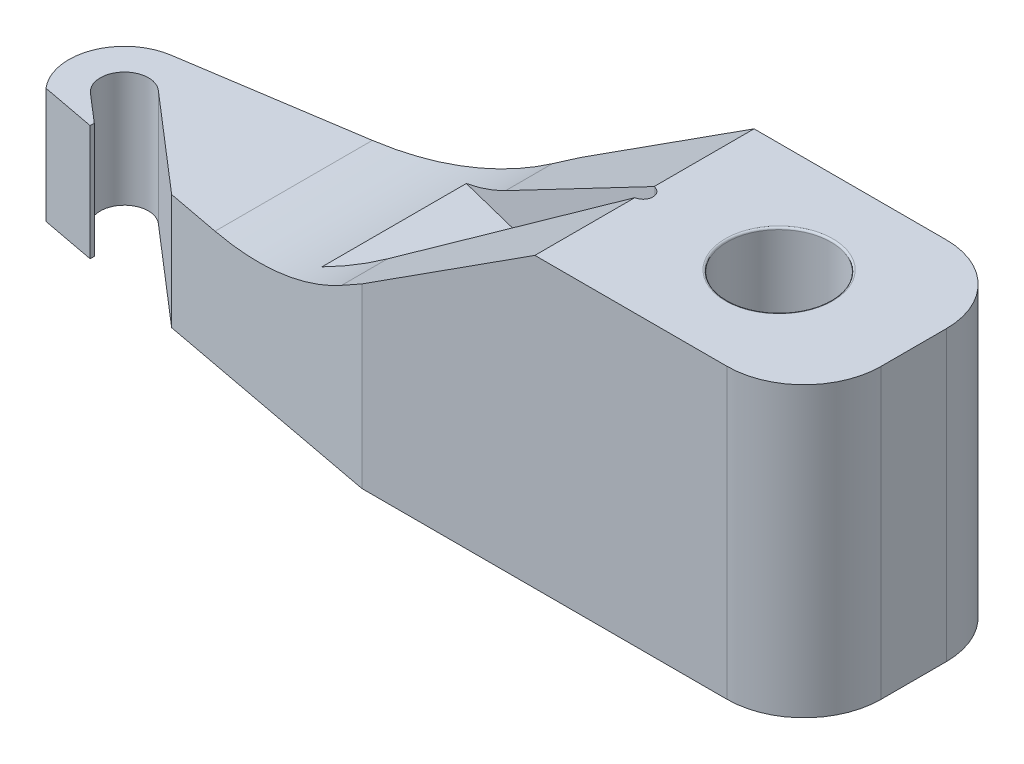
ISO-10303-21;
HEADER;
FILE_DESCRIPTION(('STEP AP214'),'2;1');
FILE_NAME('part.step','',(''),(''),'','','');
FILE_SCHEMA(('AUTOMOTIVE_DESIGN { 1 0 10303 214 1 1 1 1 }'));
ENDSEC;
DATA;
#1=APPLICATION_CONTEXT('core data for automotive mechanical design processes');
#2=APPLICATION_PROTOCOL_DEFINITION('international standard','automotive_design',2000,#1);
#3=PRODUCT_CONTEXT('',#1,'mechanical');
#4=PRODUCT('Part','Part','',(#3));
#5=PRODUCT_RELATED_PRODUCT_CATEGORY('part','',(#4));
#6=PRODUCT_DEFINITION_FORMATION('','',#4);
#7=PRODUCT_DEFINITION_CONTEXT('part definition',#1,'design');
#8=PRODUCT_DEFINITION('design','',#6,#7);
#9=PRODUCT_DEFINITION_SHAPE('','',#8);
#10=(LENGTH_UNIT() NAMED_UNIT(*) SI_UNIT(.MILLI.,.METRE.));
#11=(NAMED_UNIT(*) PLANE_ANGLE_UNIT() SI_UNIT($,.RADIAN.));
#12=(NAMED_UNIT(*) SI_UNIT($,.STERADIAN.) SOLID_ANGLE_UNIT());
#13=UNCERTAINTY_MEASURE_WITH_UNIT(LENGTH_MEASURE(1.E-05),#10,'distance_accuracy_value','');
#14=(GEOMETRIC_REPRESENTATION_CONTEXT(3) GLOBAL_UNCERTAINTY_ASSIGNED_CONTEXT((#13)) GLOBAL_UNIT_ASSIGNED_CONTEXT((#10,
#11,#12)) REPRESENTATION_CONTEXT('',''));
#15=CARTESIAN_POINT('',(0.,0.,0.));
#16=DIRECTION('',(0.,0.,1.));
#17=DIRECTION('',(1.,0.,0.));
#18=AXIS2_PLACEMENT_3D('',#15,#16,#17);
#19=CARTESIAN_POINT('',(-2.1,0.6,-0.57));
#20=DIRECTION('',(0.540757591313499,-0.841178475376553,0.));
#21=DIRECTION('',(0.841178475376554,0.540757591313499,0.));
#22=AXIS2_PLACEMENT_3D('',#19,#20,#21);
#23=PLANE('',#22);
#24=DIRECTION('',(0.,0.,1.));
#25=VECTOR('',#24,1.);
#26=CARTESIAN_POINT('',(-0.7,1.5,-0.57));
#27=LINE('',#26,#25);
#28=CARTESIAN_POINT('',(-0.7,1.5,0.05));
#29=VERTEX_POINT('',#28);
#30=CARTESIAN_POINT('',(-0.7,1.5,0.57));
#31=VERTEX_POINT('',#30);
#32=EDGE_CURVE('E325',#29,#31,#27,.T.);
#33=ORIENTED_EDGE('',*,*,#32,.F.);
#34=DIRECTION('',(-0.823173444852997,-0.529182928834069,0.205793361213249));
#35=VECTOR('',#34,1.);
#36=CARTESIAN_POINT('',(-1.93567847882455,0.705635263612792,0.358919619706137));
#37=LINE('',#36,#35);
#38=CARTESIAN_POINT('',(-1.72941644254529,0.83823228693517,0.307354110636323));
#39=VERTEX_POINT('',#38);
#40=EDGE_CURVE('E711',#29,#39,#37,.T.);
#41=ORIENTED_EDGE('',*,*,#40,.T.);
#42=DIRECTION('',(0.,0.,1.));
#43=VECTOR('',#42,1.);
#44=CARTESIAN_POINT('',(-1.72941644254529,0.83823228693517,0.475788473531962));
#45=LINE('',#44,#43);
#46=CARTESIAN_POINT('',(-1.72941644254529,0.838232286935169,0.54561495879549));
#47=VERTEX_POINT('',#46);
#48=EDGE_CURVE('E207',#39,#47,#45,.T.);
#49=ORIENTED_EDGE('',*,*,#48,.T.);
#50=DIRECTION('',(0.830807665061852,0.534090641825476,0.156543316653647));
#51=VECTOR('',#50,1.);
#52=CARTESIAN_POINT('',(-0.313018976374494,1.74877351518783,0.812496893542314));
#53=LINE('',#52,#51);
#54=CARTESIAN_POINT('',(-1.6,0.921428571428571,0.57));
#55=VERTEX_POINT('',#54);
#56=EDGE_CURVE('E702',#47,#55,#53,.T.);
#57=ORIENTED_EDGE('',*,*,#56,.T.);
#58=DIRECTION('',(0.841178475376553,0.540757591313499,0.));
#59=VECTOR('',#58,1.);
#60=CARTESIAN_POINT('',(-2.1,0.6,0.57));
#61=LINE('',#60,#59);
#62=EDGE_CURVE('E706',#55,#31,#61,.T.);
#63=ORIENTED_EDGE('',*,*,#62,.T.);
#64=EDGE_LOOP('',(#33,#41,#49,#57,#63));
#65=FACE_BOUND('',#64,.T.);
#66=ADVANCED_FACE('F41',(#65),#23,.F.);
#67=CARTESIAN_POINT('',(-0.122581688768,1.5,-0.797181053542187));
#68=DIRECTION('',(0.151982635355264,0.,0.98838316383398));
#69=DIRECTION('',(0.98838316383398,0.,-0.151982635355264));
#70=AXIS2_PLACEMENT_3D('',#67,#68,#69);
#71=PLANE('',#70);
#72=DIRECTION('',(0.98838316383398,0.,-0.151982635355264));
#73=VECTOR('',#72,1.);
#74=CARTESIAN_POINT('',(-0.122581688768,0.6,-0.797181053542187));
#75=LINE('',#74,#73);
#76=CARTESIAN_POINT('',(-3.44884977111822,0.6,-0.285704323108317));
#77=VERTEX_POINT('',#76);
#78=CARTESIAN_POINT('',(-2.54055282951554,0.6,-0.42537218464333));
#79=VERTEX_POINT('',#78);
#80=EDGE_CURVE('E648',#77,#79,#75,.T.);
#81=ORIENTED_EDGE('',*,*,#80,.T.);
#82=CARTESIAN_POINT('',(-2.54055282951554,2.1,-0.42537218464333));
#83=DIRECTION('',(0.151982635355264,0.,0.98838316383398));
#84=DIRECTION('',(0.98838316383398,0.,-0.151982635355264));
#85=AXIS2_PLACEMENT_3D('',#82,#83,#84);
#86=ELLIPSE('',#85,1.51763005976492,1.5);
#87=CARTESIAN_POINT('',(-1.72941644254529,0.83823228693517,-0.55009977029552));
#88=VERTEX_POINT('',#87);
#89=EDGE_CURVE('E281',#79,#88,#86,.T.);
#90=ORIENTED_EDGE('',*,*,#89,.T.);
#91=DIRECTION('',(0.834228815681276,0.536289952937963,-0.128278484029133));
#92=VECTOR('',#91,1.);
#93=CARTESIAN_POINT('',(-0.28865118713038,1.76443852255904,-0.771644722150891));
#94=LINE('',#93,#92);
#95=CARTESIAN_POINT('',(-1.6,0.921428571428571,-0.57));
#96=VERTEX_POINT('',#95);
#97=EDGE_CURVE('E266',#88,#96,#94,.T.);
#98=ORIENTED_EDGE('',*,*,#97,.T.);
#99=DIRECTION('',(0.,-1.,0.));
#100=VECTOR('',#99,1.);
#101=CARTESIAN_POINT('',(-1.6,1.5,-0.57));
#102=LINE('',#101,#100);
#103=CARTESIAN_POINT('',(-1.6,0.,-0.57));
#104=VERTEX_POINT('',#103);
#105=EDGE_CURVE('E349',#96,#104,#102,.T.);
#106=ORIENTED_EDGE('',*,*,#105,.T.);
#107=DIRECTION('',(-0.98838316383398,0.,0.151982635355264));
#108=VECTOR('',#107,1.);
#109=CARTESIAN_POINT('',(-0.122581688768,0.,-0.797181053542187));
#110=LINE('',#109,#108);
#111=CARTESIAN_POINT('',(-3.44884977111822,0.,-0.285704323108316));
#112=VERTEX_POINT('',#111);
#113=EDGE_CURVE('E643',#104,#112,#110,.T.);
#114=ORIENTED_EDGE('',*,*,#113,.T.);
#115=DIRECTION('',(0.,-1.,0.));
#116=VECTOR('',#115,1.);
#117=CARTESIAN_POINT('',(-3.44884977111822,1.5,-0.285704323108316));
#118=LINE('',#117,#116);
#119=EDGE_CURVE('E375',#77,#112,#118,.T.);
#120=ORIENTED_EDGE('',*,*,#119,.F.);
#121=EDGE_LOOP('',(#81,#90,#98,#106,#114,#120));
#122=FACE_BOUND('',#121,.T.);
#123=ADVANCED_FACE('F232',(#122),#71,.F.);
#124=CARTESIAN_POINT('',(-3.40491731906192,1.5,0.));
#125=DIRECTION('',(0.,-1.,0.));
#126=DIRECTION('',(0.,0.,-1.));
#127=AXIS2_PLACEMENT_3D('',#124,#125,#126);
#128=CYLINDRICAL_SURFACE('',#127,0.28906231263598);
#129=DIRECTION('',(0.,-1.,0.));
#130=VECTOR('',#129,1.);
#131=CARTESIAN_POINT('',(-3.62393969185987,1.5,0.188643104301263));
#132=LINE('',#131,#130);
#133=CARTESIAN_POINT('',(-3.62393969185987,0.6,0.188643104301263));
#134=VERTEX_POINT('',#133);
#135=CARTESIAN_POINT('',(-3.62393969185987,0.,0.188643104301263));
#136=VERTEX_POINT('',#135);
#137=EDGE_CURVE('E372',#134,#136,#132,.T.);
#138=ORIENTED_EDGE('',*,*,#137,.F.);
#139=CARTESIAN_POINT('',(-3.40491731906192,0.6,0.));
#140=DIRECTION('',(0.,-1.,0.));
#141=DIRECTION('',(0.,0.,-1.));
#142=AXIS2_PLACEMENT_3D('',#139,#140,#141);
#143=CIRCLE('',#142,0.28906231263598);
#144=EDGE_CURVE('E729',#134,#77,#143,.T.);
#145=ORIENTED_EDGE('',*,*,#144,.T.);
#146=ORIENTED_EDGE('',*,*,#119,.T.);
#147=CARTESIAN_POINT('',(-3.40491731906192,0.,0.));
#148=DIRECTION('',(0.,1.,0.));
#149=DIRECTION('',(0.,0.,1.));
#150=AXIS2_PLACEMENT_3D('',#147,#148,#149);
#151=CIRCLE('',#150,0.28906231263598);
#152=EDGE_CURVE('E647',#112,#136,#151,.T.);
#153=ORIENTED_EDGE('',*,*,#152,.T.);
#154=EDGE_LOOP('',(#138,#145,#146,#153));
#155=FACE_BOUND('',#154,.T.);
#156=ADVANCED_FACE('F239',(#155),#128,.T.);
#157=CARTESIAN_POINT('',(-0.158576359536371,1.5,0.84159744291039));
#158=DIRECTION('',(-0.185164745978843,0.,0.982707493024547));
#159=DIRECTION('',(0.982707493024547,0.,0.185164745978843));
#160=AXIS2_PLACEMENT_3D('',#157,#158,#159);
#161=PLANE('',#160);
#162=DIRECTION('',(0.982707493024547,0.,0.185164745978843));
#163=VECTOR('',#162,1.);
#164=CARTESIAN_POINT('',(-0.158576359536371,0.6,0.84159744291039));
#165=LINE('',#164,#163);
#166=CARTESIAN_POINT('',(-3.34104041971964,0.6,0.241947848831319));
#167=VERTEX_POINT('',#166);
#168=EDGE_CURVE('E726',#134,#167,#165,.T.);
#169=ORIENTED_EDGE('',*,*,#168,.F.);
#170=ORIENTED_EDGE('',*,*,#137,.T.);
#171=DIRECTION('',(-0.982707493024547,0.,-0.185164745978843));
#172=VECTOR('',#171,1.);
#173=CARTESIAN_POINT('',(-0.158576359536371,0.,0.84159744291039));
#174=LINE('',#173,#172);
#175=CARTESIAN_POINT('',(-3.34104041971964,0.,0.241947848831319));
#176=VERTEX_POINT('',#175);
#177=EDGE_CURVE('E652',#176,#136,#174,.T.);
#178=ORIENTED_EDGE('',*,*,#177,.F.);
#179=DIRECTION('',(0.,-1.,0.));
#180=VECTOR('',#179,1.);
#181=CARTESIAN_POINT('',(-3.34104041971964,1.5,0.241947848831319));
#182=LINE('',#181,#180);
#183=EDGE_CURVE('E369',#167,#176,#182,.T.);
#184=ORIENTED_EDGE('',*,*,#183,.F.);
#185=EDGE_LOOP('',(#169,#170,#178,#184));
#186=FACE_BOUND('',#185,.T.);
#187=ADVANCED_FACE('F439',(#186),#161,.T.);
#188=CARTESIAN_POINT('',(-3.34104041971964,1.5,0.));
#189=DIRECTION('',(1.,0.,0.));
#190=DIRECTION('',(0.,0.,-1.));
#191=AXIS2_PLACEMENT_3D('',#188,#189,#190);
#192=PLANE('',#191);
#193=DIRECTION('',(0.,0.,-1.));
#194=VECTOR('',#193,1.);
#195=CARTESIAN_POINT('',(-3.34104041971964,0.6,0.));
#196=LINE('',#195,#194);
#197=CARTESIAN_POINT('',(-3.34104041971964,0.6,0.220416717461304));
#198=VERTEX_POINT('',#197);
#199=EDGE_CURVE('E694',#167,#198,#196,.T.);
#200=ORIENTED_EDGE('',*,*,#199,.F.);
#201=ORIENTED_EDGE('',*,*,#183,.T.);
#202=DIRECTION('',(0.,0.,1.));
#203=VECTOR('',#202,1.);
#204=CARTESIAN_POINT('',(-3.34104041971964,0.,0.));
#205=LINE('',#204,#203);
#206=CARTESIAN_POINT('',(-3.34104041971964,0.,0.220416717461304));
#207=VERTEX_POINT('',#206);
#208=EDGE_CURVE('E656',#207,#176,#205,.T.);
#209=ORIENTED_EDGE('',*,*,#208,.F.);
#210=DIRECTION('',(0.,-1.,0.));
#211=VECTOR('',#210,1.);
#212=CARTESIAN_POINT('',(-3.34104041971964,1.5,0.220416717461304));
#213=LINE('',#212,#211);
#214=EDGE_CURVE('E366',#198,#207,#213,.T.);
#215=ORIENTED_EDGE('',*,*,#214,.F.);
#216=EDGE_LOOP('',(#200,#201,#209,#215));
#217=FACE_BOUND('',#216,.T.);
#218=ADVANCED_FACE('F435',(#217),#192,.T.);
#219=CARTESIAN_POINT('',(-1.53458974614962,1.5,1.77883251141445));
#220=DIRECTION('',(0.653211468979728,0.,-0.757175525749047));
#221=DIRECTION('',(-0.757175525749047,0.,-0.653211468979728));
#222=AXIS2_PLACEMENT_3D('',#219,#220,#221);
#223=PLANE('',#222);
#224=DIRECTION('',(-0.757175525749047,0.,-0.653211468979728));
#225=VECTOR('',#224,1.);
#226=CARTESIAN_POINT('',(-1.53458974614962,0.6,1.77883251141445));
#227=LINE('',#226,#225);
#228=CARTESIAN_POINT('',(-3.4866791589274,0.6,0.0947749190366315));
#229=VERTEX_POINT('',#228);
#230=EDGE_CURVE('E690',#198,#229,#227,.T.);
#231=ORIENTED_EDGE('',*,*,#230,.F.);
#232=ORIENTED_EDGE('',*,*,#214,.T.);
#233=DIRECTION('',(0.757175525749047,0.,0.653211468979728));
#234=VECTOR('',#233,1.);
#235=CARTESIAN_POINT('',(-1.53458974614962,0.,1.77883251141445));
#236=LINE('',#235,#234);
#237=CARTESIAN_POINT('',(-3.4866791589274,0.,0.0947749190366317));
#238=VERTEX_POINT('',#237);
#239=EDGE_CURVE('E660',#238,#207,#236,.T.);
#240=ORIENTED_EDGE('',*,*,#239,.F.);
#241=DIRECTION('',(0.,-1.,0.));
#242=VECTOR('',#241,1.);
#243=CARTESIAN_POINT('',(-3.4866791589274,1.5,0.0947749190366317));
#244=LINE('',#243,#242);
#245=EDGE_CURVE('E363',#229,#238,#244,.T.);
#246=ORIENTED_EDGE('',*,*,#245,.F.);
#247=EDGE_LOOP('',(#231,#232,#240,#246));
#248=FACE_BOUND('',#247,.T.);
#249=ADVANCED_FACE('F431',(#248),#223,.T.);
#250=CARTESIAN_POINT('',(-3.40491731906192,1.5,0.));
#251=DIRECTION('',(0.,-1.,0.));
#252=DIRECTION('',(0.,0.,-1.));
#253=AXIS2_PLACEMENT_3D('',#250,#251,#252);
#254=CYLINDRICAL_SURFACE('',#253,0.125169020674399);
#255=CARTESIAN_POINT('',(-3.40491731906192,0.6,0.));
#256=DIRECTION('',(0.,-1.,0.));
#257=DIRECTION('',(0.,0.,-1.));
#258=AXIS2_PLACEMENT_3D('',#255,#256,#257);
#259=CIRCLE('',#258,0.125169020674399);
#260=CARTESIAN_POINT('',(-3.32315547919644,0.6,-0.0947749190366312));
#261=VERTEX_POINT('',#260);
#262=EDGE_CURVE('E684',#229,#261,#259,.T.);
#263=ORIENTED_EDGE('',*,*,#262,.F.);
#264=ORIENTED_EDGE('',*,*,#245,.T.);
#265=CARTESIAN_POINT('',(-3.40491731906192,0.,0.));
#266=DIRECTION('',(0.,1.,0.));
#267=DIRECTION('',(0.,0.,1.));
#268=AXIS2_PLACEMENT_3D('',#265,#266,#267);
#269=CIRCLE('',#268,0.125169020674399);
#270=CARTESIAN_POINT('',(-3.32315547919644,0.,-0.0947749190366312));
#271=VERTEX_POINT('',#270);
#272=EDGE_CURVE('E664',#271,#238,#269,.T.);
#273=ORIENTED_EDGE('',*,*,#272,.F.);
#274=DIRECTION('',(0.,-1.,0.));
#275=VECTOR('',#274,1.);
#276=CARTESIAN_POINT('',(-3.32315547919644,1.5,-0.0947749190366312));
#277=LINE('',#276,#275);
#278=EDGE_CURVE('E360',#261,#271,#277,.T.);
#279=ORIENTED_EDGE('',*,*,#278,.F.);
#280=EDGE_LOOP('',(#263,#264,#273,#279));
#281=FACE_BOUND('',#280,.T.);
#282=ADVANCED_FACE('F427',(#281),#254,.F.);
#283=CARTESIAN_POINT('',(-1.37106606641866,1.5,1.58928267334119));
#284=DIRECTION('',(0.653211468979728,0.,-0.757175525749047));
#285=DIRECTION('',(-0.757175525749047,0.,-0.653211468979728));
#286=AXIS2_PLACEMENT_3D('',#283,#284,#285);
#287=PLANE('',#286);
#288=DIRECTION('',(0.,-1.,0.));
#289=VECTOR('',#288,1.);
#290=CARTESIAN_POINT('',(-2.81877033922845,1.5,0.340355571854638));
#291=LINE('',#290,#289);
#292=CARTESIAN_POINT('',(-2.81877033922845,0.6,0.340355571854638));
#293=VERTEX_POINT('',#292);
#294=CARTESIAN_POINT('',(-2.81877033922845,0.,0.340355571854638));
#295=VERTEX_POINT('',#294);
#296=EDGE_CURVE('E357',#293,#295,#291,.T.);
#297=ORIENTED_EDGE('',*,*,#296,.F.);
#298=DIRECTION('',(-0.757175525749047,0.,-0.653211468979728));
#299=VECTOR('',#298,1.);
#300=CARTESIAN_POINT('',(-1.37106606641866,0.6,1.58928267334119));
#301=LINE('',#300,#299);
#302=EDGE_CURVE('E682',#293,#261,#301,.T.);
#303=ORIENTED_EDGE('',*,*,#302,.T.);
#304=ORIENTED_EDGE('',*,*,#278,.T.);
#305=DIRECTION('',(0.757175525749047,0.,0.653211468979728));
#306=VECTOR('',#305,1.);
#307=CARTESIAN_POINT('',(-1.37106606641866,0.,1.58928267334119));
#308=LINE('',#307,#306);
#309=EDGE_CURVE('E668',#271,#295,#308,.T.);
#310=ORIENTED_EDGE('',*,*,#309,.T.);
#311=EDGE_LOOP('',(#297,#303,#304,#310));
#312=FACE_BOUND('',#311,.T.);
#313=ADVANCED_FACE('F423',(#312),#287,.F.);
#314=CARTESIAN_POINT('',(-0.158576359536371,1.5,0.84159744291039));
#315=DIRECTION('',(-0.185164745978843,0.,0.982707493024547));
#316=DIRECTION('',(0.982707493024547,0.,0.185164745978843));
#317=AXIS2_PLACEMENT_3D('',#314,#315,#316);
#318=PLANE('',#317);
#319=ORIENTED_EDGE('',*,*,#56,.F.);
#320=CARTESIAN_POINT('',(-2.54055282951554,2.1,0.392778164415018));
#321=DIRECTION('',(-0.185164745978843,0.,0.982707493024547));
#322=DIRECTION('',(-0.982707493024547,0.,-0.185164745978843));
#323=AXIS2_PLACEMENT_3D('',#320,#321,#322);
#324=ELLIPSE('',#323,1.52639519963702,1.5);
#325=CARTESIAN_POINT('',(-2.54055282951554,0.6,0.392778164415018));
#326=VERTEX_POINT('',#325);
#327=EDGE_CURVE('E273',#47,#326,#324,.F.);
#328=ORIENTED_EDGE('',*,*,#327,.T.);
#329=DIRECTION('',(0.982707493024547,0.,0.185164745978843));
#330=VECTOR('',#329,1.);
#331=CARTESIAN_POINT('',(-0.158576359536371,0.6,0.84159744291039));
#332=LINE('',#331,#330);
#333=EDGE_CURVE('E378',#293,#326,#332,.T.);
#334=ORIENTED_EDGE('',*,*,#333,.F.);
#335=ORIENTED_EDGE('',*,*,#296,.T.);
#336=DIRECTION('',(-0.982707493024547,0.,-0.185164745978843));
#337=VECTOR('',#336,1.);
#338=CARTESIAN_POINT('',(-0.158576359536371,0.,0.84159744291039));
#339=LINE('',#338,#337);
#340=CARTESIAN_POINT('',(-1.6,0.,0.57));
#341=VERTEX_POINT('',#340);
#342=EDGE_CURVE('E345',#341,#295,#339,.T.);
#343=ORIENTED_EDGE('',*,*,#342,.F.);
#344=DIRECTION('',(0.,-1.,0.));
#345=VECTOR('',#344,1.);
#346=CARTESIAN_POINT('',(-1.6,1.5,0.57));
#347=LINE('',#346,#345);
#348=EDGE_CURVE('E353',#55,#341,#347,.T.);
#349=ORIENTED_EDGE('',*,*,#348,.F.);
#350=EDGE_LOOP('',(#319,#328,#334,#335,#343,#349));
#351=FACE_BOUND('',#350,.T.);
#352=ADVANCED_FACE('F420',(#351),#318,.T.);
#353=CARTESIAN_POINT('',(0.,1.5,0.57));
#354=DIRECTION('',(0.,0.,1.));
#355=DIRECTION('',(1.,0.,0.));
#356=AXIS2_PLACEMENT_3D('',#353,#354,#355);
#357=PLANE('',#356);
#358=DIRECTION('',(-1.,0.,0.));
#359=VECTOR('',#358,1.);
#360=CARTESIAN_POINT('',(0.,0.,0.57));
#361=LINE('',#360,#359);
#362=CARTESIAN_POINT('',(0.3,0.,0.57));
#363=VERTEX_POINT('',#362);
#364=EDGE_CURVE('E318',#363,#341,#361,.T.);
#365=ORIENTED_EDGE('',*,*,#364,.F.);
#366=DIRECTION('',(0.,-1.,0.));
#367=VECTOR('',#366,1.);
#368=CARTESIAN_POINT('',(0.3,1.5,0.57));
#369=LINE('',#368,#367);
#370=CARTESIAN_POINT('',(0.3,1.5,0.57));
#371=VERTEX_POINT('',#370);
#372=EDGE_CURVE('E196',#363,#371,#369,.F.);
#373=ORIENTED_EDGE('',*,*,#372,.T.);
#374=DIRECTION('',(-1.,0.,0.));
#375=VECTOR('',#374,1.);
#376=CARTESIAN_POINT('',(0.,1.5,0.57));
#377=LINE('',#376,#375);
#378=EDGE_CURVE('E315',#371,#31,#377,.T.);
#379=ORIENTED_EDGE('',*,*,#378,.T.);
#380=ORIENTED_EDGE('',*,*,#62,.F.);
#381=ORIENTED_EDGE('',*,*,#348,.T.);
#382=EDGE_LOOP('',(#365,#373,#379,#380,#381));
#383=FACE_BOUND('',#382,.T.);
#384=ADVANCED_FACE('F313',(#383),#357,.T.);
#385=CARTESIAN_POINT('',(0.7,1.5,0.));
#386=DIRECTION('',(1.,0.,0.));
#387=DIRECTION('',(0.,0.,-1.));
#388=AXIS2_PLACEMENT_3D('',#385,#386,#387);
#389=PLANE('',#388);
#390=DIRECTION('',(0.,0.,1.));
#391=VECTOR('',#390,1.);
#392=CARTESIAN_POINT('',(0.7,0.,0.));
#393=LINE('',#392,#391);
#394=CARTESIAN_POINT('',(0.7,0.,-0.17));
#395=VERTEX_POINT('',#394);
#396=CARTESIAN_POINT('',(0.7,0.,0.17));
#397=VERTEX_POINT('',#396);
#398=EDGE_CURVE('E336',#395,#397,#393,.T.);
#399=ORIENTED_EDGE('',*,*,#398,.F.);
#400=DIRECTION('',(0.,-1.,0.));
#401=VECTOR('',#400,1.);
#402=CARTESIAN_POINT('',(0.7,1.5,-0.17));
#403=LINE('',#402,#401);
#404=CARTESIAN_POINT('',(0.7,1.5,-0.17));
#405=VERTEX_POINT('',#404);
#406=EDGE_CURVE('E298',#395,#405,#403,.F.);
#407=ORIENTED_EDGE('',*,*,#406,.T.);
#408=DIRECTION('',(0.,0.,1.));
#409=VECTOR('',#408,1.);
#410=CARTESIAN_POINT('',(0.7,1.5,0.));
#411=LINE('',#410,#409);
#412=CARTESIAN_POINT('',(0.7,1.5,0.17));
#413=VERTEX_POINT('',#412);
#414=EDGE_CURVE('E327',#405,#413,#411,.T.);
#415=ORIENTED_EDGE('',*,*,#414,.T.);
#416=DIRECTION('',(0.,-1.,0.));
#417=VECTOR('',#416,1.);
#418=CARTESIAN_POINT('',(0.7,1.5,0.17));
#419=LINE('',#418,#417);
#420=EDGE_CURVE('E294',#413,#397,#419,.T.);
#421=ORIENTED_EDGE('',*,*,#420,.T.);
#422=EDGE_LOOP('',(#399,#407,#415,#421));
#423=FACE_BOUND('',#422,.T.);
#424=ADVANCED_FACE('F335',(#423),#389,.T.);
#425=CARTESIAN_POINT('',(0.,1.5,-0.57));
#426=DIRECTION('',(0.,0.,1.));
#427=DIRECTION('',(1.,0.,0.));
#428=AXIS2_PLACEMENT_3D('',#425,#426,#427);
#429=PLANE('',#428);
#430=DIRECTION('',(-1.,0.,0.));
#431=VECTOR('',#430,1.);
#432=CARTESIAN_POINT('',(0.,1.5,-0.57));
#433=LINE('',#432,#431);
#434=CARTESIAN_POINT('',(0.3,1.5,-0.57));
#435=VERTEX_POINT('',#434);
#436=CARTESIAN_POINT('',(-0.7,1.5,-0.57));
#437=VERTEX_POINT('',#436);
#438=EDGE_CURVE('E354',#435,#437,#433,.T.);
#439=ORIENTED_EDGE('',*,*,#438,.F.);
#440=DIRECTION('',(0.,-1.,0.));
#441=VECTOR('',#440,1.);
#442=CARTESIAN_POINT('',(0.3,0.,-0.57));
#443=LINE('',#442,#441);
#444=CARTESIAN_POINT('',(0.3,0.,-0.57));
#445=VERTEX_POINT('',#444);
#446=EDGE_CURVE('E284',#435,#445,#443,.T.);
#447=ORIENTED_EDGE('',*,*,#446,.T.);
#448=DIRECTION('',(-1.,0.,0.));
#449=VECTOR('',#448,1.);
#450=CARTESIAN_POINT('',(0.,0.,-0.57));
#451=LINE('',#450,#449);
#452=EDGE_CURVE('E328',#445,#104,#451,.T.);
#453=ORIENTED_EDGE('',*,*,#452,.T.);
#454=ORIENTED_EDGE('',*,*,#105,.F.);
#455=DIRECTION('',(0.841178475376553,0.540757591313499,0.));
#456=VECTOR('',#455,1.);
#457=CARTESIAN_POINT('',(-2.1,0.6,-0.57));
#458=LINE('',#457,#456);
#459=EDGE_CURVE('E637',#96,#437,#458,.T.);
#460=ORIENTED_EDGE('',*,*,#459,.T.);
#461=EDGE_LOOP('',(#439,#447,#453,#454,#460));
#462=FACE_BOUND('',#461,.T.);
#463=ADVANCED_FACE('F405',(#462),#429,.F.);
#464=CARTESIAN_POINT('',(0.,1.5,0.));
#465=DIRECTION('',(0.,-1.,0.));
#466=DIRECTION('',(0.,0.,-1.));
#467=AXIS2_PLACEMENT_3D('',#464,#465,#466);
#468=CYLINDRICAL_SURFACE('',#467,0.27);
#469=CARTESIAN_POINT('',(0.,0.01,0.));
#470=DIRECTION('',(0.,1.,0.));
#471=DIRECTION('',(0.,0.,1.));
#472=AXIS2_PLACEMENT_3D('',#469,#470,#471);
#473=CIRCLE('',#472,0.27);
#474=CARTESIAN_POINT('',(0.,0.01,0.27));
#475=VERTEX_POINT('',#474);
#476=EDGE_CURVE('E389',#475,#475,#473,.F.);
#477=ORIENTED_EDGE('',*,*,#476,.T.);
#478=EDGE_LOOP('',(#477));
#479=FACE_BOUND('',#478,.T.);
#480=CARTESIAN_POINT('',(0.,1.49,0.));
#481=DIRECTION('',(0.,1.,0.));
#482=DIRECTION('',(0.,0.,1.));
#483=AXIS2_PLACEMENT_3D('',#480,#481,#482);
#484=CIRCLE('',#483,0.27);
#485=CARTESIAN_POINT('',(0.,1.49,0.27));
#486=VERTEX_POINT('',#485);
#487=EDGE_CURVE('E386',#486,#486,#484,.T.);
#488=ORIENTED_EDGE('',*,*,#487,.T.);
#489=EDGE_LOOP('',(#488));
#490=FACE_BOUND('',#489,.T.);
#491=ADVANCED_FACE('F403',(#479,#490),#468,.F.);
#492=CARTESIAN_POINT('',(0.,1.5,0.));
#493=DIRECTION('',(0.,1.,0.));
#494=DIRECTION('',(0.,0.,1.));
#495=AXIS2_PLACEMENT_3D('',#492,#493,#494);
#496=PLANE('',#495);
#497=DIRECTION('',(0.970142500145332,0.,-0.242535625036333));
#498=VECTOR('',#497,1.);
#499=CARTESIAN_POINT('',(-2.5,1.5,0.5));
#500=LINE('',#499,#498);
#501=CARTESIAN_POINT('',(-0.694028500029066,1.5,0.0485071250072665));
#502=VERTEX_POINT('',#501);
#503=EDGE_CURVE('E741',#29,#502,#500,.T.);
#504=ORIENTED_EDGE('',*,*,#503,.F.);
#505=ORIENTED_EDGE('',*,*,#32,.T.);
#506=ORIENTED_EDGE('',*,*,#378,.F.);
#507=CARTESIAN_POINT('',(0.3,1.5,0.17));
#508=DIRECTION('',(0.,1.,0.));
#509=DIRECTION('',(0.,0.,1.));
#510=AXIS2_PLACEMENT_3D('',#507,#508,#509);
#511=CIRCLE('',#510,0.4);
#512=EDGE_CURVE('E301',#371,#413,#511,.T.);
#513=ORIENTED_EDGE('',*,*,#512,.T.);
#514=ORIENTED_EDGE('',*,*,#414,.F.);
#515=CARTESIAN_POINT('',(0.3,1.5,-0.17));
#516=DIRECTION('',(0.,1.,0.));
#517=DIRECTION('',(0.,0.,1.));
#518=AXIS2_PLACEMENT_3D('',#515,#516,#517);
#519=CIRCLE('',#518,0.4);
#520=EDGE_CURVE('E304',#405,#435,#519,.T.);
#521=ORIENTED_EDGE('',*,*,#520,.T.);
#522=ORIENTED_EDGE('',*,*,#438,.T.);
#523=CARTESIAN_POINT('',(-0.7,1.5,-0.05));
#524=VERTEX_POINT('',#523);
#525=EDGE_CURVE('E704',#437,#524,#27,.T.);
#526=ORIENTED_EDGE('',*,*,#525,.T.);
#527=DIRECTION('',(-0.970142500145332,0.,-0.242535625036333));
#528=VECTOR('',#527,1.);
#529=CARTESIAN_POINT('',(-0.5,1.5,0.));
#530=LINE('',#529,#528);
#531=CARTESIAN_POINT('',(-0.694028500029066,1.5,-0.0485071250072666));
#532=VERTEX_POINT('',#531);
#533=EDGE_CURVE('E202',#532,#524,#530,.T.);
#534=ORIENTED_EDGE('',*,*,#533,.F.);
#535=CARTESIAN_POINT('',(-0.706155281280883,1.5,0.));
#536=DIRECTION('',(0.,1.,0.));
#537=DIRECTION('',(0.,0.,1.));
#538=AXIS2_PLACEMENT_3D('',#535,#536,#537);
#539=CIRCLE('',#538,0.05);
#540=EDGE_CURVE('E11',#532,#502,#539,.F.);
#541=ORIENTED_EDGE('',*,*,#540,.T.);
#542=EDGE_LOOP('',(#504,#505,#506,#513,#514,#521,#522,#526,#534,#541));
#543=FACE_BOUND('',#542,.T.);
#544=CARTESIAN_POINT('',(0.,1.5,0.));
#545=DIRECTION('',(0.,1.,0.));
#546=DIRECTION('',(0.,0.,1.));
#547=AXIS2_PLACEMENT_3D('',#544,#545,#546);
#548=CIRCLE('',#547,0.28);
#549=CARTESIAN_POINT('',(0.,1.5,0.28));
#550=VERTEX_POINT('',#549);
#551=EDGE_CURVE('E275',#550,#550,#548,.F.);
#552=ORIENTED_EDGE('',*,*,#551,.T.);
#553=EDGE_LOOP('',(#552));
#554=FACE_BOUND('',#553,.T.);
#555=ADVANCED_FACE('F321',(#543,#554),#496,.T.);
#556=CARTESIAN_POINT('',(0.,0.,0.));
#557=DIRECTION('',(0.,1.,0.));
#558=DIRECTION('',(0.,0.,1.));
#559=AXIS2_PLACEMENT_3D('',#556,#557,#558);
#560=PLANE('',#559);
#561=CARTESIAN_POINT('',(0.,0.,0.));
#562=DIRECTION('',(0.,1.,0.));
#563=DIRECTION('',(0.,0.,1.));
#564=AXIS2_PLACEMENT_3D('',#561,#562,#563);
#565=CIRCLE('',#564,0.28);
#566=CARTESIAN_POINT('',(0.,0.,0.28));
#567=VERTEX_POINT('',#566);
#568=EDGE_CURVE('E382',#567,#567,#565,.T.);
#569=ORIENTED_EDGE('',*,*,#568,.T.);
#570=EDGE_LOOP('',(#569));
#571=FACE_BOUND('',#570,.T.);
#572=ORIENTED_EDGE('',*,*,#452,.F.);
#573=CARTESIAN_POINT('',(0.3,0.,-0.17));
#574=DIRECTION('',(0.,1.,0.));
#575=DIRECTION('',(0.,0.,1.));
#576=AXIS2_PLACEMENT_3D('',#573,#574,#575);
#577=CIRCLE('',#576,0.4);
#578=EDGE_CURVE('E291',#445,#395,#577,.F.);
#579=ORIENTED_EDGE('',*,*,#578,.T.);
#580=ORIENTED_EDGE('',*,*,#398,.T.);
#581=CARTESIAN_POINT('',(0.3,0.,0.17));
#582=DIRECTION('',(0.,1.,0.));
#583=DIRECTION('',(0.,0.,1.));
#584=AXIS2_PLACEMENT_3D('',#581,#582,#583);
#585=CIRCLE('',#584,0.4);
#586=EDGE_CURVE('E288',#397,#363,#585,.F.);
#587=ORIENTED_EDGE('',*,*,#586,.T.);
#588=ORIENTED_EDGE('',*,*,#364,.T.);
#589=ORIENTED_EDGE('',*,*,#342,.T.);
#590=ORIENTED_EDGE('',*,*,#309,.F.);
#591=ORIENTED_EDGE('',*,*,#272,.T.);
#592=ORIENTED_EDGE('',*,*,#239,.T.);
#593=ORIENTED_EDGE('',*,*,#208,.T.);
#594=ORIENTED_EDGE('',*,*,#177,.T.);
#595=ORIENTED_EDGE('',*,*,#152,.F.);
#596=ORIENTED_EDGE('',*,*,#113,.F.);
#597=EDGE_LOOP('',(#572,#579,#580,#587,#588,#589,#590,#591,#592,#593,#594,#595,#596));
#598=FACE_BOUND('',#597,.T.);
#599=ADVANCED_FACE('F256',(#571,#598),#560,.F.);
#600=CARTESIAN_POINT('',(-4.25446125197741,0.6,-0.57));
#601=DIRECTION('',(0.,-1.,0.));
#602=DIRECTION('',(0.,0.,-1.));
#603=AXIS2_PLACEMENT_3D('',#600,#601,#602);
#604=PLANE('',#603);
#605=ORIENTED_EDGE('',*,*,#333,.T.);
#606=DIRECTION('',(0.,0.,1.));
#607=VECTOR('',#606,1.);
#608=CARTESIAN_POINT('',(-2.54055282951554,0.6,-0.49311552800752));
#609=LINE('',#608,#607);
#610=EDGE_CURVE('E269',#326,#79,#609,.F.);
#611=ORIENTED_EDGE('',*,*,#610,.T.);
#612=ORIENTED_EDGE('',*,*,#80,.F.);
#613=ORIENTED_EDGE('',*,*,#144,.F.);
#614=ORIENTED_EDGE('',*,*,#168,.T.);
#615=ORIENTED_EDGE('',*,*,#199,.T.);
#616=ORIENTED_EDGE('',*,*,#230,.T.);
#617=ORIENTED_EDGE('',*,*,#262,.T.);
#618=ORIENTED_EDGE('',*,*,#302,.F.);
#619=EDGE_LOOP('',(#605,#611,#612,#613,#614,#615,#616,#617,#618));
#620=FACE_BOUND('',#619,.T.);
#621=ADVANCED_FACE('F247',(#620),#604,.F.);
#622=CARTESIAN_POINT('',(-1.72941644254529,0.83823228693517,-0.307354110636323));
#623=VERTEX_POINT('',#622);
#624=EDGE_CURVE('E262',#88,#623,#45,.T.);
#625=ORIENTED_EDGE('',*,*,#624,.T.);
#626=DIRECTION('',(0.823173444852997,0.529182928834069,0.205793361213249));
#627=VECTOR('',#626,1.);
#628=CARTESIAN_POINT('',(-2.12879861711322,0.581486603284356,-0.407199654278306));
#629=LINE('',#628,#627);
#630=EDGE_CURVE('E224',#623,#524,#629,.T.);
#631=ORIENTED_EDGE('',*,*,#630,.T.);
#632=ORIENTED_EDGE('',*,*,#525,.F.);
#633=ORIENTED_EDGE('',*,*,#459,.F.);
#634=ORIENTED_EDGE('',*,*,#97,.F.);
#635=EDGE_LOOP('',(#625,#631,#632,#633,#634));
#636=FACE_BOUND('',#635,.T.);
#637=ADVANCED_FACE('F235',(#636),#23,.F.);
#638=CARTESIAN_POINT('',(0.,0.01,0.));
#639=DIRECTION('',(0.,1.,0.));
#640=DIRECTION('',(0.,0.,1.));
#641=AXIS2_PLACEMENT_3D('',#638,#639,#640);
#642=TOROIDAL_SURFACE('',#641,0.28,0.01);
#643=ORIENTED_EDGE('',*,*,#476,.F.);
#644=EDGE_LOOP('',(#643));
#645=FACE_BOUND('',#644,.T.);
#646=ORIENTED_EDGE('',*,*,#568,.F.);
#647=EDGE_LOOP('',(#646));
#648=FACE_BOUND('',#647,.T.);
#649=ADVANCED_FACE('F246',(#645,#648),#642,.T.);
#650=CARTESIAN_POINT('',(0.,1.49,0.));
#651=DIRECTION('',(0.,1.,0.));
#652=DIRECTION('',(0.,0.,1.));
#653=AXIS2_PLACEMENT_3D('',#650,#651,#652);
#654=TOROIDAL_SURFACE('',#653,0.28,0.01);
#655=ORIENTED_EDGE('',*,*,#551,.F.);
#656=EDGE_LOOP('',(#655));
#657=FACE_BOUND('',#656,.T.);
#658=ORIENTED_EDGE('',*,*,#487,.F.);
#659=EDGE_LOOP('',(#658));
#660=FACE_BOUND('',#659,.T.);
#661=ADVANCED_FACE('F253',(#657,#660),#654,.T.);
#662=CARTESIAN_POINT('',(-2.54055282951554,2.1,-0.57));
#663=DIRECTION('',(0.,0.,-1.));
#664=DIRECTION('',(-1.,0.,0.));
#665=AXIS2_PLACEMENT_3D('',#662,#663,#664);
#666=CYLINDRICAL_SURFACE('',#665,1.5);
#667=ORIENTED_EDGE('',*,*,#48,.F.);
#668=CARTESIAN_POINT('',(-2.54055282951554,2.1,0.510138207378885));
#669=DIRECTION('',(0.242535625036333,0.,0.970142500145332));
#670=DIRECTION('',(0.970142500145332,0.,-0.242535625036333));
#671=AXIS2_PLACEMENT_3D('',#668,#669,#670);
#672=ELLIPSE('',#671,1.54616460960662,1.5);
#673=CARTESIAN_POINT('',(-2.00203634880209,0.7,0.375509087200522));
#674=VERTEX_POINT('',#673);
#675=EDGE_CURVE('E199',#39,#674,#672,.F.);
#676=ORIENTED_EDGE('',*,*,#675,.T.);
#677=DIRECTION('',(0.,0.,-1.));
#678=VECTOR('',#677,1.);
#679=CARTESIAN_POINT('',(-2.00203634880209,0.7,-0.57));
#680=LINE('',#679,#678);
#681=CARTESIAN_POINT('',(-2.00203634880209,0.7,-0.375509087200522));
#682=VERTEX_POINT('',#681);
#683=EDGE_CURVE('E184',#674,#682,#680,.T.);
#684=ORIENTED_EDGE('',*,*,#683,.T.);
#685=CARTESIAN_POINT('',(-2.54055282951554,2.1,-0.510138207378885));
#686=DIRECTION('',(0.242535625036333,0.,-0.970142500145332));
#687=DIRECTION('',(-0.970142500145332,0.,-0.242535625036333));
#688=AXIS2_PLACEMENT_3D('',#685,#686,#687);
#689=ELLIPSE('',#688,1.54616460960662,1.5);
#690=EDGE_CURVE('E195',#682,#623,#689,.F.);
#691=ORIENTED_EDGE('',*,*,#690,.T.);
#692=ORIENTED_EDGE('',*,*,#624,.F.);
#693=ORIENTED_EDGE('',*,*,#89,.F.);
#694=ORIENTED_EDGE('',*,*,#610,.F.);
#695=ORIENTED_EDGE('',*,*,#327,.F.);
#696=EDGE_LOOP('',(#667,#676,#684,#691,#692,#693,#694,#695));
#697=FACE_BOUND('',#696,.T.);
#698=ADVANCED_FACE('F205',(#697),#666,.F.);
#699=CARTESIAN_POINT('',(0.3,1.5,-0.17));
#700=DIRECTION('',(0.,1.,0.));
#701=DIRECTION('',(0.,0.,1.));
#702=AXIS2_PLACEMENT_3D('',#699,#700,#701);
#703=CYLINDRICAL_SURFACE('',#702,0.4);
#704=ORIENTED_EDGE('',*,*,#520,.F.);
#705=ORIENTED_EDGE('',*,*,#406,.F.);
#706=ORIENTED_EDGE('',*,*,#578,.F.);
#707=ORIENTED_EDGE('',*,*,#446,.F.);
#708=EDGE_LOOP('',(#704,#705,#706,#707));
#709=FACE_BOUND('',#708,.T.);
#710=ADVANCED_FACE('F449',(#709),#703,.T.);
#711=CARTESIAN_POINT('',(0.3,1.5,0.17));
#712=DIRECTION('',(0.,-1.,0.));
#713=DIRECTION('',(0.,0.,-1.));
#714=AXIS2_PLACEMENT_3D('',#711,#712,#713);
#715=CYLINDRICAL_SURFACE('',#714,0.4);
#716=ORIENTED_EDGE('',*,*,#512,.F.);
#717=ORIENTED_EDGE('',*,*,#372,.F.);
#718=ORIENTED_EDGE('',*,*,#586,.F.);
#719=ORIENTED_EDGE('',*,*,#420,.F.);
#720=EDGE_LOOP('',(#716,#717,#718,#719));
#721=FACE_BOUND('',#720,.T.);
#722=ADVANCED_FACE('F331',(#721),#715,.T.);
#723=CARTESIAN_POINT('',(-2.5,0.7,0.5));
#724=DIRECTION('',(0.242535625036333,0.,0.970142500145332));
#725=DIRECTION('',(0.970142500145332,0.,-0.242535625036333));
#726=AXIS2_PLACEMENT_3D('',#723,#724,#725);
#727=PLANE('',#726);
#728=ORIENTED_EDGE('',*,*,#503,.T.);
#729=DIRECTION('',(0.,1.,0.));
#730=VECTOR('',#729,1.);
#731=CARTESIAN_POINT('',(-0.694028500029066,0.7,0.0485071250072666));
#732=LINE('',#731,#730);
#733=CARTESIAN_POINT('',(-0.694028500029066,0.7,0.0485071250072665));
#734=VERTEX_POINT('',#733);
#735=EDGE_CURVE('E57',#502,#734,#732,.F.);
#736=ORIENTED_EDGE('',*,*,#735,.T.);
#737=DIRECTION('',(0.970142500145332,0.,-0.242535625036333));
#738=VECTOR('',#737,1.);
#739=CARTESIAN_POINT('',(-2.5,0.7,0.5));
#740=LINE('',#739,#738);
#741=EDGE_CURVE('E186',#674,#734,#740,.T.);
#742=ORIENTED_EDGE('',*,*,#741,.F.);
#743=ORIENTED_EDGE('',*,*,#675,.F.);
#744=ORIENTED_EDGE('',*,*,#40,.F.);
#745=EDGE_LOOP('',(#728,#736,#742,#743,#744));
#746=FACE_BOUND('',#745,.T.);
#747=ADVANCED_FACE('F198',(#746),#727,.F.);
#748=CARTESIAN_POINT('',(-0.5,0.7,0.));
#749=DIRECTION('',(0.242535625036333,0.,-0.970142500145332));
#750=DIRECTION('',(-0.970142500145332,0.,-0.242535625036333));
#751=AXIS2_PLACEMENT_3D('',#748,#749,#750);
#752=PLANE('',#751);
#753=DIRECTION('',(-0.970142500145332,0.,-0.242535625036333));
#754=VECTOR('',#753,1.);
#755=CARTESIAN_POINT('',(-0.5,0.7,0.));
#756=LINE('',#755,#754);
#757=CARTESIAN_POINT('',(-0.694028500029066,0.7,-0.0485071250072666));
#758=VERTEX_POINT('',#757);
#759=EDGE_CURVE('E189',#758,#682,#756,.T.);
#760=ORIENTED_EDGE('',*,*,#759,.F.);
#761=DIRECTION('',(0.,1.,0.));
#762=VECTOR('',#761,1.);
#763=CARTESIAN_POINT('',(-0.694028500029066,1.5,-0.0485071250072666));
#764=LINE('',#763,#762);
#765=EDGE_CURVE('E209',#758,#532,#764,.T.);
#766=ORIENTED_EDGE('',*,*,#765,.T.);
#767=ORIENTED_EDGE('',*,*,#533,.T.);
#768=ORIENTED_EDGE('',*,*,#630,.F.);
#769=ORIENTED_EDGE('',*,*,#690,.F.);
#770=EDGE_LOOP('',(#760,#766,#767,#768,#769));
#771=FACE_BOUND('',#770,.T.);
#772=ADVANCED_FACE('F222',(#771),#752,.F.);
#773=CARTESIAN_POINT('',(0.,0.7,0.));
#774=DIRECTION('',(0.,-1.,0.));
#775=DIRECTION('',(0.,0.,-1.));
#776=AXIS2_PLACEMENT_3D('',#773,#774,#775);
#777=PLANE('',#776);
#778=ORIENTED_EDGE('',*,*,#741,.T.);
#779=CARTESIAN_POINT('',(-0.706155281280883,0.7,0.));
#780=DIRECTION('',(0.,-1.,0.));
#781=DIRECTION('',(0.,0.,-1.));
#782=AXIS2_PLACEMENT_3D('',#779,#780,#781);
#783=CIRCLE('',#782,0.05);
#784=EDGE_CURVE('E50',#734,#758,#783,.F.);
#785=ORIENTED_EDGE('',*,*,#784,.T.);
#786=ORIENTED_EDGE('',*,*,#759,.T.);
#787=ORIENTED_EDGE('',*,*,#683,.F.);
#788=EDGE_LOOP('',(#778,#785,#786,#787));
#789=FACE_BOUND('',#788,.T.);
#790=ADVANCED_FACE('F185',(#789),#777,.F.);
#791=CARTESIAN_POINT('',(-0.706155281280883,0.7,0.));
#792=DIRECTION('',(0.,-1.,0.));
#793=DIRECTION('',(0.,0.,-1.));
#794=AXIS2_PLACEMENT_3D('',#791,#792,#793);
#795=CYLINDRICAL_SURFACE('',#794,0.05);
#796=ORIENTED_EDGE('',*,*,#784,.F.);
#797=ORIENTED_EDGE('',*,*,#735,.F.);
#798=ORIENTED_EDGE('',*,*,#540,.F.);
#799=ORIENTED_EDGE('',*,*,#765,.F.);
#800=EDGE_LOOP('',(#796,#797,#798,#799));
#801=FACE_BOUND('',#800,.T.);
#802=ADVANCED_FACE('F43',(#801),#795,.F.);
#803=CLOSED_SHELL('',(#66,#123,#156,#187,#218,#249,#282,#313,#352,#384,#424,#463,#491,#555,#599,
#621,#637,#649,#661,#698,#710,#722,#747,#772,#790,#802));
#804=MANIFOLD_SOLID_BREP('B2',#803);
#805=ADVANCED_BREP_SHAPE_REPRESENTATION('',(#18,#804),#14);
#806=SHAPE_DEFINITION_REPRESENTATION(#9,#805);
ENDSEC;
END-ISO-10303-21;
